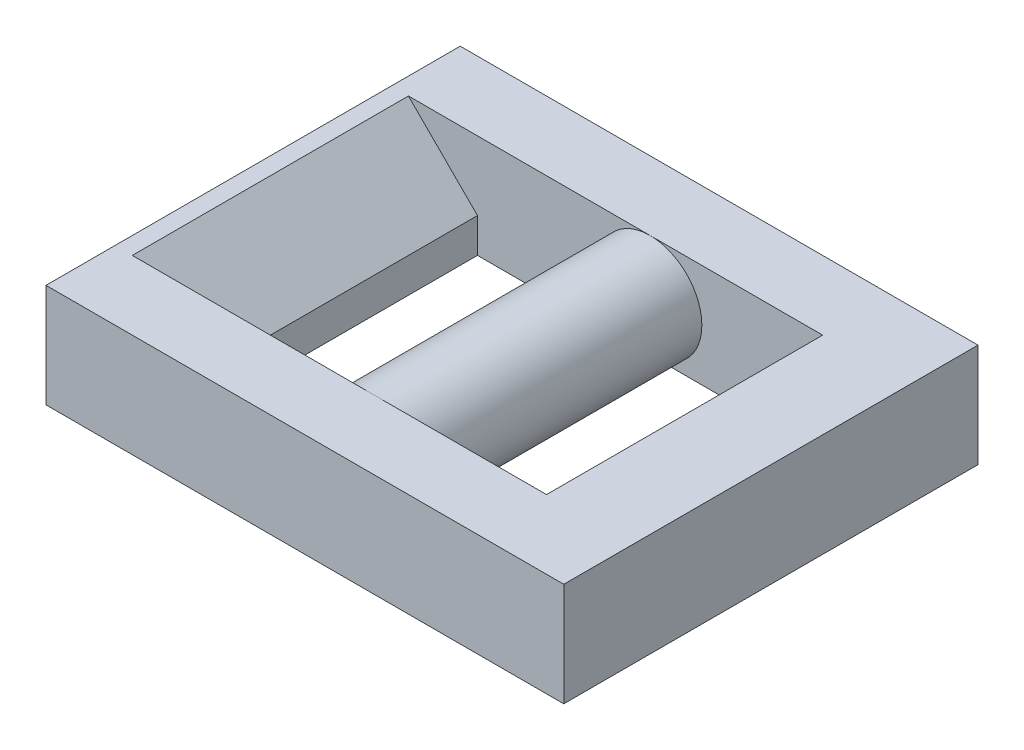
ISO-10303-21;
HEADER;
FILE_DESCRIPTION(('STEP AP214'),'2;1');
FILE_NAME('part.step','',(''),(''),'','','');
FILE_SCHEMA(('AUTOMOTIVE_DESIGN { 1 0 10303 214 1 1 1 1 }'));
ENDSEC;
DATA;
#1=APPLICATION_CONTEXT('core data for automotive mechanical design processes');
#2=APPLICATION_PROTOCOL_DEFINITION('international standard','automotive_design',2000,#1);
#3=PRODUCT_CONTEXT('',#1,'mechanical');
#4=PRODUCT('Part','Part','',(#3));
#5=PRODUCT_RELATED_PRODUCT_CATEGORY('part','',(#4));
#6=PRODUCT_DEFINITION_FORMATION('','',#4);
#7=PRODUCT_DEFINITION_CONTEXT('part definition',#1,'design');
#8=PRODUCT_DEFINITION('design','',#6,#7);
#9=PRODUCT_DEFINITION_SHAPE('','',#8);
#10=(LENGTH_UNIT() NAMED_UNIT(*) SI_UNIT(.MILLI.,.METRE.));
#11=(NAMED_UNIT(*) PLANE_ANGLE_UNIT() SI_UNIT($,.RADIAN.));
#12=(NAMED_UNIT(*) SI_UNIT($,.STERADIAN.) SOLID_ANGLE_UNIT());
#13=UNCERTAINTY_MEASURE_WITH_UNIT(LENGTH_MEASURE(1.E-05),#10,'distance_accuracy_value','');
#14=(GEOMETRIC_REPRESENTATION_CONTEXT(3) GLOBAL_UNCERTAINTY_ASSIGNED_CONTEXT((#13)) GLOBAL_UNIT_ASSIGNED_CONTEXT((#10,
#11,#12)) REPRESENTATION_CONTEXT('',''));
#15=CARTESIAN_POINT('',(0.,0.,0.));
#16=DIRECTION('',(0.,0.,1.));
#17=DIRECTION('',(1.,0.,0.));
#18=AXIS2_PLACEMENT_3D('',#15,#16,#17);
#19=CARTESIAN_POINT('',(5.,1.5,4.));
#20=DIRECTION('',(0.,0.,-1.));
#21=DIRECTION('',(-1.,0.,0.));
#22=AXIS2_PLACEMENT_3D('',#19,#20,#21);
#23=PLANE('',#22);
#24=DIRECTION('',(1.,0.,0.));
#25=VECTOR('',#24,1.);
#26=CARTESIAN_POINT('',(5.,-1.5,4.));
#27=LINE('',#26,#25);
#28=CARTESIAN_POINT('',(0.,-1.5,4.));
#29=VERTEX_POINT('',#28);
#30=CARTESIAN_POINT('',(7.,-1.5,4.));
#31=VERTEX_POINT('',#30);
#32=EDGE_CURVE('E143',#29,#31,#27,.T.);
#33=ORIENTED_EDGE('',*,*,#32,.F.);
#34=CARTESIAN_POINT('',(0.,0.,4.));
#35=DIRECTION('',(0.,0.,-1.));
#36=DIRECTION('',(-1.,0.,0.));
#37=AXIS2_PLACEMENT_3D('',#34,#35,#36);
#38=CIRCLE('',#37,1.5);
#39=CARTESIAN_POINT('',(0.,1.5,4.));
#40=VERTEX_POINT('',#39);
#41=EDGE_CURVE('E133',#40,#29,#38,.T.);
#42=ORIENTED_EDGE('',*,*,#41,.F.);
#43=DIRECTION('',(1.,0.,0.));
#44=VECTOR('',#43,1.);
#45=CARTESIAN_POINT('',(5.,1.5,4.));
#46=LINE('',#45,#44);
#47=CARTESIAN_POINT('',(5.,1.5,4.));
#48=VERTEX_POINT('',#47);
#49=EDGE_CURVE('E140',#40,#48,#46,.T.);
#50=ORIENTED_EDGE('',*,*,#49,.T.);
#51=DIRECTION('',(0.,-1.,0.));
#52=VECTOR('',#51,1.);
#53=CARTESIAN_POINT('',(5.,1.5,4.));
#54=LINE('',#53,#52);
#55=CARTESIAN_POINT('',(5.,0.500000000000007,4.));
#56=VERTEX_POINT('',#55);
#57=EDGE_CURVE('E175',#48,#56,#54,.T.);
#58=ORIENTED_EDGE('',*,*,#57,.T.);
#59=DIRECTION('',(0.707106781186546,-0.707106781186549,0.));
#60=VECTOR('',#59,1.);
#61=CARTESIAN_POINT('',(7.,-1.5,4.));
#62=LINE('',#61,#60);
#63=EDGE_CURVE('E219',#56,#31,#62,.T.);
#64=ORIENTED_EDGE('',*,*,#63,.T.);
#65=EDGE_LOOP('',(#33,#42,#50,#58,#64));
#66=FACE_BOUND('',#65,.T.);
#67=ADVANCED_FACE('F39',(#66),#23,.T.);
#68=CARTESIAN_POINT('',(5.,1.5,-4.));
#69=DIRECTION('',(0.,0.,1.));
#70=DIRECTION('',(1.,0.,0.));
#71=AXIS2_PLACEMENT_3D('',#68,#69,#70);
#72=PLANE('',#71);
#73=DIRECTION('',(-1.,0.,0.));
#74=VECTOR('',#73,1.);
#75=CARTESIAN_POINT('',(5.,-1.5,-4.));
#76=LINE('',#75,#74);
#77=CARTESIAN_POINT('',(0.,-1.5,-4.));
#78=VERTEX_POINT('',#77);
#79=CARTESIAN_POINT('',(-5.,-1.5,-4.));
#80=VERTEX_POINT('',#79);
#81=EDGE_CURVE('E168',#78,#80,#76,.T.);
#82=ORIENTED_EDGE('',*,*,#81,.F.);
#83=CARTESIAN_POINT('',(0.,0.,-4.));
#84=DIRECTION('',(0.,0.,1.));
#85=DIRECTION('',(1.,0.,0.));
#86=AXIS2_PLACEMENT_3D('',#83,#84,#85);
#87=CIRCLE('',#86,1.5);
#88=CARTESIAN_POINT('',(0.,1.5,-4.));
#89=VERTEX_POINT('',#88);
#90=EDGE_CURVE('E145',#89,#78,#87,.T.);
#91=ORIENTED_EDGE('',*,*,#90,.F.);
#92=DIRECTION('',(-1.,0.,0.));
#93=VECTOR('',#92,1.);
#94=CARTESIAN_POINT('',(5.,1.5,-4.));
#95=LINE('',#94,#93);
#96=CARTESIAN_POINT('',(-7.00000000000001,1.5,-4.));
#97=VERTEX_POINT('',#96);
#98=EDGE_CURVE('E62',#89,#97,#95,.T.);
#99=ORIENTED_EDGE('',*,*,#98,.T.);
#100=DIRECTION('',(-0.707106781186548,0.707106781186547,0.));
#101=VECTOR('',#100,1.);
#102=CARTESIAN_POINT('',(-5.,-0.500000000000001,-4.));
#103=LINE('',#102,#101);
#104=CARTESIAN_POINT('',(-5.,-0.500000000000002,-4.));
#105=VERTEX_POINT('',#104);
#106=EDGE_CURVE('E11',#97,#105,#103,.F.);
#107=ORIENTED_EDGE('',*,*,#106,.T.);
#108=DIRECTION('',(0.,-1.,0.));
#109=VECTOR('',#108,1.);
#110=CARTESIAN_POINT('',(-5.,1.5,-4.));
#111=LINE('',#110,#109);
#112=EDGE_CURVE('E162',#105,#80,#111,.T.);
#113=ORIENTED_EDGE('',*,*,#112,.T.);
#114=EDGE_LOOP('',(#82,#91,#99,#107,#113));
#115=FACE_BOUND('',#114,.T.);
#116=ADVANCED_FACE('F230',(#115),#72,.T.);
#117=CARTESIAN_POINT('',(0.,1.5,0.));
#118=DIRECTION('',(0.,1.,0.));
#119=DIRECTION('',(0.,0.,1.));
#120=AXIS2_PLACEMENT_3D('',#117,#118,#119);
#121=PLANE('',#120);
#122=DIRECTION('',(0.,0.,1.));
#123=VECTOR('',#122,1.);
#124=CARTESIAN_POINT('',(-7.5,1.5,6.));
#125=LINE('',#124,#123);
#126=CARTESIAN_POINT('',(-7.5,1.5,-6.));
#127=VERTEX_POINT('',#126);
#128=CARTESIAN_POINT('',(-7.5,1.5,6.));
#129=VERTEX_POINT('',#128);
#130=EDGE_CURVE('E180',#127,#129,#125,.T.);
#131=ORIENTED_EDGE('',*,*,#130,.T.);
#132=DIRECTION('',(1.,0.,0.));
#133=VECTOR('',#132,1.);
#134=CARTESIAN_POINT('',(7.5,1.5,6.));
#135=LINE('',#134,#133);
#136=CARTESIAN_POINT('',(7.5,1.5,6.));
#137=VERTEX_POINT('',#136);
#138=EDGE_CURVE('E183',#129,#137,#135,.T.);
#139=ORIENTED_EDGE('',*,*,#138,.T.);
#140=DIRECTION('',(0.,0.,-1.));
#141=VECTOR('',#140,1.);
#142=CARTESIAN_POINT('',(7.5,1.5,6.));
#143=LINE('',#142,#141);
#144=CARTESIAN_POINT('',(7.5,1.5,-6.));
#145=VERTEX_POINT('',#144);
#146=EDGE_CURVE('E186',#137,#145,#143,.T.);
#147=ORIENTED_EDGE('',*,*,#146,.T.);
#148=DIRECTION('',(-1.,0.,0.));
#149=VECTOR('',#148,1.);
#150=CARTESIAN_POINT('',(7.5,1.5,-6.));
#151=LINE('',#150,#149);
#152=EDGE_CURVE('E188',#145,#127,#151,.T.);
#153=ORIENTED_EDGE('',*,*,#152,.T.);
#154=EDGE_LOOP('',(#131,#139,#147,#153));
#155=FACE_BOUND('',#154,.T.);
#156=CARTESIAN_POINT('',(-7.00000000000001,1.5,4.));
#157=VERTEX_POINT('',#156);
#158=EDGE_CURVE('E55',#157,#40,#46,.T.);
#159=ORIENTED_EDGE('',*,*,#158,.F.);
#160=DIRECTION('',(0.,0.,-1.));
#161=VECTOR('',#160,1.);
#162=CARTESIAN_POINT('',(-7.00000000000001,1.5,0.));
#163=LINE('',#162,#161);
#164=EDGE_CURVE('E224',#157,#97,#163,.T.);
#165=ORIENTED_EDGE('',*,*,#164,.T.);
#166=ORIENTED_EDGE('',*,*,#98,.F.);
#167=CARTESIAN_POINT('',(5.,1.5,-4.));
#168=VERTEX_POINT('',#167);
#169=EDGE_CURVE('E159',#168,#89,#95,.T.);
#170=ORIENTED_EDGE('',*,*,#169,.F.);
#171=DIRECTION('',(0.,0.,-1.));
#172=VECTOR('',#171,1.);
#173=CARTESIAN_POINT('',(5.,1.5,4.));
#174=LINE('',#173,#172);
#175=EDGE_CURVE('E150',#48,#168,#174,.T.);
#176=ORIENTED_EDGE('',*,*,#175,.F.);
#177=ORIENTED_EDGE('',*,*,#49,.F.);
#178=EDGE_LOOP('',(#159,#165,#166,#170,#176,#177));
#179=FACE_BOUND('',#178,.T.);
#180=ADVANCED_FACE('F147',(#155,#179),#121,.T.);
#181=CARTESIAN_POINT('',(0.,-1.5,0.));
#182=DIRECTION('',(0.,1.,0.));
#183=DIRECTION('',(0.,0.,1.));
#184=AXIS2_PLACEMENT_3D('',#181,#182,#183);
#185=PLANE('',#184);
#186=DIRECTION('',(0.,0.,1.));
#187=VECTOR('',#186,1.);
#188=CARTESIAN_POINT('',(-7.5,-1.5,6.));
#189=LINE('',#188,#187);
#190=CARTESIAN_POINT('',(-7.5,-1.5,-6.));
#191=VERTEX_POINT('',#190);
#192=CARTESIAN_POINT('',(-7.5,-1.5,6.));
#193=VERTEX_POINT('',#192);
#194=EDGE_CURVE('E179',#191,#193,#189,.T.);
#195=ORIENTED_EDGE('',*,*,#194,.F.);
#196=DIRECTION('',(-1.,0.,0.));
#197=VECTOR('',#196,1.);
#198=CARTESIAN_POINT('',(7.5,-1.5,-6.));
#199=LINE('',#198,#197);
#200=CARTESIAN_POINT('',(7.5,-1.5,-6.));
#201=VERTEX_POINT('',#200);
#202=EDGE_CURVE('E184',#201,#191,#199,.T.);
#203=ORIENTED_EDGE('',*,*,#202,.F.);
#204=DIRECTION('',(0.,0.,-1.));
#205=VECTOR('',#204,1.);
#206=CARTESIAN_POINT('',(7.5,-1.5,6.));
#207=LINE('',#206,#205);
#208=CARTESIAN_POINT('',(7.5,-1.5,6.));
#209=VERTEX_POINT('',#208);
#210=EDGE_CURVE('E195',#209,#201,#207,.T.);
#211=ORIENTED_EDGE('',*,*,#210,.F.);
#212=DIRECTION('',(1.,0.,0.));
#213=VECTOR('',#212,1.);
#214=CARTESIAN_POINT('',(7.5,-1.5,6.));
#215=LINE('',#214,#213);
#216=EDGE_CURVE('E193',#193,#209,#215,.T.);
#217=ORIENTED_EDGE('',*,*,#216,.F.);
#218=EDGE_LOOP('',(#195,#203,#211,#217));
#219=FACE_BOUND('',#218,.T.);
#220=DIRECTION('',(0.,0.,-1.));
#221=VECTOR('',#220,1.);
#222=CARTESIAN_POINT('',(7.,-1.5,-4.));
#223=LINE('',#222,#221);
#224=CARTESIAN_POINT('',(7.,-1.5,-4.));
#225=VERTEX_POINT('',#224);
#226=EDGE_CURVE('E212',#31,#225,#223,.T.);
#227=ORIENTED_EDGE('',*,*,#226,.T.);
#228=EDGE_CURVE('E151',#225,#78,#76,.T.);
#229=ORIENTED_EDGE('',*,*,#228,.T.);
#230=ORIENTED_EDGE('',*,*,#81,.T.);
#231=DIRECTION('',(0.,0.,1.));
#232=VECTOR('',#231,1.);
#233=CARTESIAN_POINT('',(-5.,-1.5,4.));
#234=LINE('',#233,#232);
#235=CARTESIAN_POINT('',(-5.,-1.5,4.));
#236=VERTEX_POINT('',#235);
#237=EDGE_CURVE('E163',#80,#236,#234,.T.);
#238=ORIENTED_EDGE('',*,*,#237,.T.);
#239=EDGE_CURVE('E166',#236,#29,#27,.T.);
#240=ORIENTED_EDGE('',*,*,#239,.T.);
#241=ORIENTED_EDGE('',*,*,#32,.T.);
#242=EDGE_LOOP('',(#227,#229,#230,#238,#240,#241));
#243=FACE_BOUND('',#242,.T.);
#244=ADVANCED_FACE('F236',(#219,#243),#185,.F.);
#245=CARTESIAN_POINT('',(-7.5,1.5,6.));
#246=DIRECTION('',(1.,0.,0.));
#247=DIRECTION('',(0.,0.,-1.));
#248=AXIS2_PLACEMENT_3D('',#245,#246,#247);
#249=PLANE('',#248);
#250=ORIENTED_EDGE('',*,*,#194,.T.);
#251=DIRECTION('',(0.,-1.,0.));
#252=VECTOR('',#251,1.);
#253=CARTESIAN_POINT('',(-7.5,1.5,6.));
#254=LINE('',#253,#252);
#255=EDGE_CURVE('E206',#129,#193,#254,.T.);
#256=ORIENTED_EDGE('',*,*,#255,.F.);
#257=ORIENTED_EDGE('',*,*,#130,.F.);
#258=DIRECTION('',(0.,-1.,0.));
#259=VECTOR('',#258,1.);
#260=CARTESIAN_POINT('',(-7.5,1.5,-6.));
#261=LINE('',#260,#259);
#262=EDGE_CURVE('E190',#127,#191,#261,.T.);
#263=ORIENTED_EDGE('',*,*,#262,.T.);
#264=EDGE_LOOP('',(#250,#256,#257,#263));
#265=FACE_BOUND('',#264,.T.);
#266=ADVANCED_FACE('F280',(#265),#249,.F.);
#267=CARTESIAN_POINT('',(7.5,1.5,6.));
#268=DIRECTION('',(0.,0.,-1.));
#269=DIRECTION('',(-1.,0.,0.));
#270=AXIS2_PLACEMENT_3D('',#267,#268,#269);
#271=PLANE('',#270);
#272=ORIENTED_EDGE('',*,*,#216,.T.);
#273=DIRECTION('',(0.,-1.,0.));
#274=VECTOR('',#273,1.);
#275=CARTESIAN_POINT('',(7.5,1.5,6.));
#276=LINE('',#275,#274);
#277=EDGE_CURVE('E203',#137,#209,#276,.T.);
#278=ORIENTED_EDGE('',*,*,#277,.F.);
#279=ORIENTED_EDGE('',*,*,#138,.F.);
#280=ORIENTED_EDGE('',*,*,#255,.T.);
#281=EDGE_LOOP('',(#272,#278,#279,#280));
#282=FACE_BOUND('',#281,.T.);
#283=ADVANCED_FACE('F285',(#282),#271,.F.);
#284=CARTESIAN_POINT('',(7.5,1.5,6.));
#285=DIRECTION('',(-1.,0.,0.));
#286=DIRECTION('',(0.,0.,1.));
#287=AXIS2_PLACEMENT_3D('',#284,#285,#286);
#288=PLANE('',#287);
#289=ORIENTED_EDGE('',*,*,#210,.T.);
#290=DIRECTION('',(0.,-1.,0.));
#291=VECTOR('',#290,1.);
#292=CARTESIAN_POINT('',(7.5,1.5,-6.));
#293=LINE('',#292,#291);
#294=EDGE_CURVE('E200',#145,#201,#293,.T.);
#295=ORIENTED_EDGE('',*,*,#294,.F.);
#296=ORIENTED_EDGE('',*,*,#146,.F.);
#297=ORIENTED_EDGE('',*,*,#277,.T.);
#298=EDGE_LOOP('',(#289,#295,#296,#297));
#299=FACE_BOUND('',#298,.T.);
#300=ADVANCED_FACE('F272',(#299),#288,.F.);
#301=CARTESIAN_POINT('',(7.5,1.5,-6.));
#302=DIRECTION('',(0.,0.,1.));
#303=DIRECTION('',(1.,0.,0.));
#304=AXIS2_PLACEMENT_3D('',#301,#302,#303);
#305=PLANE('',#304);
#306=ORIENTED_EDGE('',*,*,#202,.T.);
#307=ORIENTED_EDGE('',*,*,#262,.F.);
#308=ORIENTED_EDGE('',*,*,#152,.F.);
#309=ORIENTED_EDGE('',*,*,#294,.T.);
#310=EDGE_LOOP('',(#306,#307,#308,#309));
#311=FACE_BOUND('',#310,.T.);
#312=ADVANCED_FACE('F268',(#311),#305,.F.);
#313=CARTESIAN_POINT('',(-5.,1.5,4.));
#314=DIRECTION('',(1.,0.,0.));
#315=DIRECTION('',(0.,0.,-1.));
#316=AXIS2_PLACEMENT_3D('',#313,#314,#315);
#317=PLANE('',#316);
#318=ORIENTED_EDGE('',*,*,#112,.F.);
#319=DIRECTION('',(0.,0.,1.));
#320=VECTOR('',#319,1.);
#321=CARTESIAN_POINT('',(-5.,-0.500000000000002,4.));
#322=LINE('',#321,#320);
#323=CARTESIAN_POINT('',(-5.,-0.500000000000002,4.));
#324=VERTEX_POINT('',#323);
#325=EDGE_CURVE('E221',#105,#324,#322,.T.);
#326=ORIENTED_EDGE('',*,*,#325,.T.);
#327=DIRECTION('',(0.,-1.,0.));
#328=VECTOR('',#327,1.);
#329=CARTESIAN_POINT('',(-5.,1.5,4.));
#330=LINE('',#329,#328);
#331=EDGE_CURVE('E177',#324,#236,#330,.T.);
#332=ORIENTED_EDGE('',*,*,#331,.T.);
#333=ORIENTED_EDGE('',*,*,#237,.F.);
#334=EDGE_LOOP('',(#318,#326,#332,#333));
#335=FACE_BOUND('',#334,.T.);
#336=ADVANCED_FACE('F234',(#335),#317,.T.);
#337=ORIENTED_EDGE('',*,*,#158,.T.);
#338=EDGE_CURVE('E129',#29,#40,#38,.T.);
#339=ORIENTED_EDGE('',*,*,#338,.F.);
#340=ORIENTED_EDGE('',*,*,#239,.F.);
#341=ORIENTED_EDGE('',*,*,#331,.F.);
#342=DIRECTION('',(0.707106781186548,-0.707106781186547,0.));
#343=VECTOR('',#342,1.);
#344=CARTESIAN_POINT('',(-5.,-0.500000000000002,4.));
#345=LINE('',#344,#343);
#346=EDGE_CURVE('E48',#324,#157,#345,.F.);
#347=ORIENTED_EDGE('',*,*,#346,.T.);
#348=EDGE_LOOP('',(#337,#339,#340,#341,#347));
#349=FACE_BOUND('',#348,.T.);
#350=ADVANCED_FACE('F153',(#349),#23,.T.);
#351=CARTESIAN_POINT('',(5.,1.5,4.));
#352=DIRECTION('',(-1.,0.,0.));
#353=DIRECTION('',(0.,0.,1.));
#354=AXIS2_PLACEMENT_3D('',#351,#352,#353);
#355=PLANE('',#354);
#356=DIRECTION('',(0.,-1.,0.));
#357=VECTOR('',#356,1.);
#358=CARTESIAN_POINT('',(5.,1.5,-4.));
#359=LINE('',#358,#357);
#360=CARTESIAN_POINT('',(5.,0.500000000000007,-4.));
#361=VERTEX_POINT('',#360);
#362=EDGE_CURVE('E172',#168,#361,#359,.T.);
#363=ORIENTED_EDGE('',*,*,#362,.T.);
#364=DIRECTION('',(0.,0.,1.));
#365=VECTOR('',#364,1.);
#366=CARTESIAN_POINT('',(5.,0.500000000000007,4.));
#367=LINE('',#366,#365);
#368=EDGE_CURVE('E215',#361,#56,#367,.T.);
#369=ORIENTED_EDGE('',*,*,#368,.T.);
#370=ORIENTED_EDGE('',*,*,#57,.F.);
#371=ORIENTED_EDGE('',*,*,#175,.T.);
#372=EDGE_LOOP('',(#363,#369,#370,#371));
#373=FACE_BOUND('',#372,.T.);
#374=ADVANCED_FACE('F242',(#373),#355,.T.);
#375=ORIENTED_EDGE('',*,*,#169,.T.);
#376=CARTESIAN_POINT('',(0.,0.,-4.));
#377=DIRECTION('',(0.,0.,1.));
#378=DIRECTION('',(1.,0.,0.));
#379=AXIS2_PLACEMENT_3D('',#376,#377,#378);
#380=CIRCLE('',#379,1.5);
#381=EDGE_CURVE('E209',#89,#78,#380,.F.);
#382=ORIENTED_EDGE('',*,*,#381,.T.);
#383=ORIENTED_EDGE('',*,*,#228,.F.);
#384=DIRECTION('',(-0.707106781186546,0.707106781186549,0.));
#385=VECTOR('',#384,1.);
#386=CARTESIAN_POINT('',(7.,-1.5,-4.));
#387=LINE('',#386,#385);
#388=EDGE_CURVE('E217',#225,#361,#387,.T.);
#389=ORIENTED_EDGE('',*,*,#388,.T.);
#390=ORIENTED_EDGE('',*,*,#362,.F.);
#391=EDGE_LOOP('',(#375,#382,#383,#389,#390));
#392=FACE_BOUND('',#391,.T.);
#393=ADVANCED_FACE('F238',(#392),#72,.T.);
#394=CARTESIAN_POINT('',(0.,0.,6.002));
#395=DIRECTION('',(0.,0.,-1.));
#396=DIRECTION('',(-1.,0.,0.));
#397=AXIS2_PLACEMENT_3D('',#394,#395,#396);
#398=CYLINDRICAL_SURFACE('',#397,1.5);
#399=ORIENTED_EDGE('',*,*,#41,.T.);
#400=ORIENTED_EDGE('',*,*,#338,.T.);
#401=EDGE_LOOP('',(#399,#400));
#402=FACE_BOUND('',#401,.T.);
#403=ORIENTED_EDGE('',*,*,#90,.T.);
#404=ORIENTED_EDGE('',*,*,#381,.F.);
#405=EDGE_LOOP('',(#403,#404));
#406=FACE_BOUND('',#405,.T.);
#407=ADVANCED_FACE('F131',(#402,#406),#398,.T.);
#408=CARTESIAN_POINT('',(7.,-1.5,0.));
#409=DIRECTION('',(-0.707106781186549,-0.707106781186546,0.));
#410=DIRECTION('',(0.,0.,1.));
#411=AXIS2_PLACEMENT_3D('',#408,#409,#410);
#412=PLANE('',#411);
#413=ORIENTED_EDGE('',*,*,#63,.F.);
#414=ORIENTED_EDGE('',*,*,#368,.F.);
#415=ORIENTED_EDGE('',*,*,#388,.F.);
#416=ORIENTED_EDGE('',*,*,#226,.F.);
#417=EDGE_LOOP('',(#413,#414,#415,#416));
#418=FACE_BOUND('',#417,.T.);
#419=ADVANCED_FACE('F246',(#418),#412,.T.);
#420=CARTESIAN_POINT('',(-5.,-0.500000000000002,4.));
#421=DIRECTION('',(-0.707106781186547,-0.707106781186548,0.));
#422=DIRECTION('',(0.,0.,1.));
#423=AXIS2_PLACEMENT_3D('',#420,#421,#422);
#424=PLANE('',#423);
#425=ORIENTED_EDGE('',*,*,#106,.F.);
#426=ORIENTED_EDGE('',*,*,#164,.F.);
#427=ORIENTED_EDGE('',*,*,#346,.F.);
#428=ORIENTED_EDGE('',*,*,#325,.F.);
#429=EDGE_LOOP('',(#425,#426,#427,#428));
#430=FACE_BOUND('',#429,.T.);
#431=ADVANCED_FACE('F42',(#430),#424,.F.);
#432=CLOSED_SHELL('',(#67,#116,#180,#244,#266,#283,#300,#312,#336,#350,#374,#393,#407,#419,#431));
#433=MANIFOLD_SOLID_BREP('B2',#432);
#434=ADVANCED_BREP_SHAPE_REPRESENTATION('',(#18,#433),#14);
#435=SHAPE_DEFINITION_REPRESENTATION(#9,#434);
ENDSEC;
END-ISO-10303-21;
